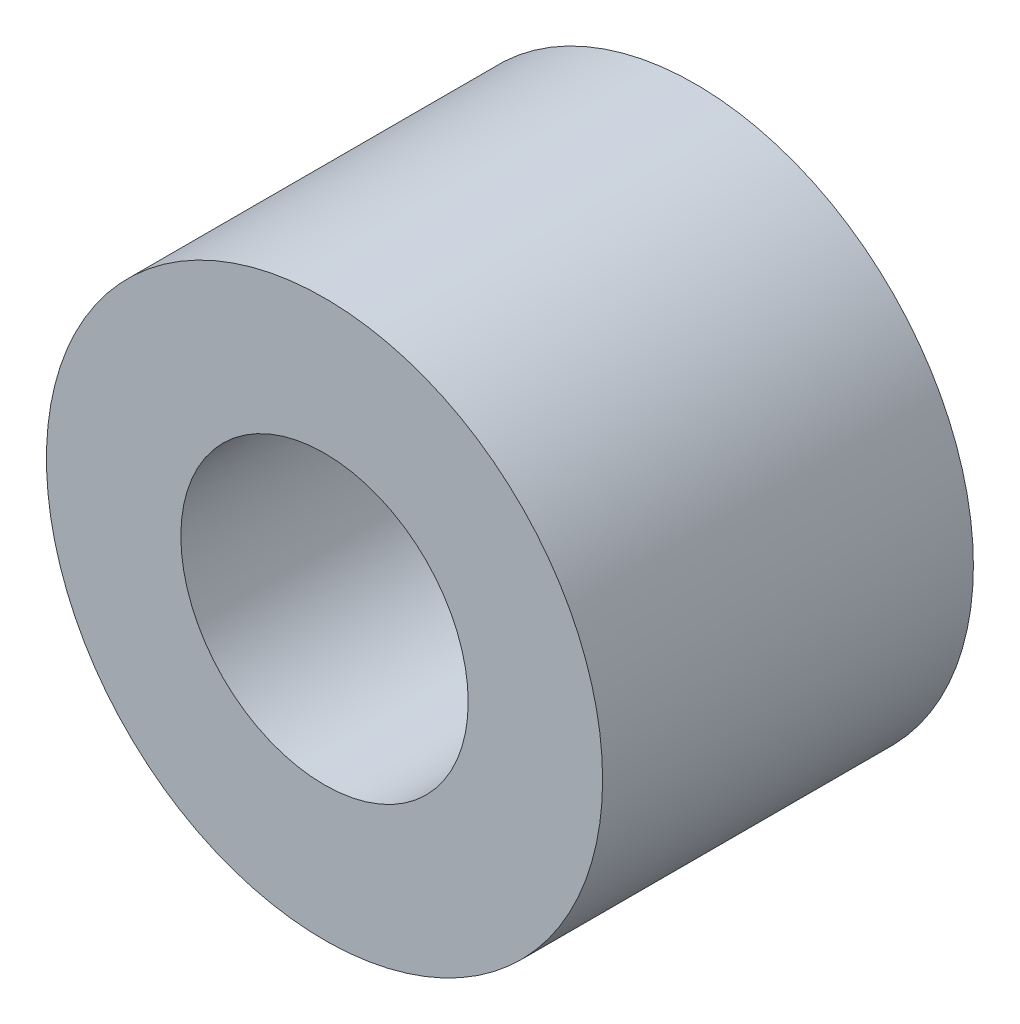
ISO-10303-21;
HEADER;
FILE_DESCRIPTION(('STEP AP214'),'2;1');
FILE_NAME('part.step','',(''),(''),'','','');
FILE_SCHEMA(('AUTOMOTIVE_DESIGN { 1 0 10303 214 1 1 1 1 }'));
ENDSEC;
DATA;
#1=APPLICATION_CONTEXT('core data for automotive mechanical design processes');
#2=APPLICATION_PROTOCOL_DEFINITION('international standard','automotive_design',2000,#1);
#3=PRODUCT_CONTEXT('',#1,'mechanical');
#4=PRODUCT('Part','Part','',(#3));
#5=PRODUCT_RELATED_PRODUCT_CATEGORY('part','',(#4));
#6=PRODUCT_DEFINITION_FORMATION('','',#4);
#7=PRODUCT_DEFINITION_CONTEXT('part definition',#1,'design');
#8=PRODUCT_DEFINITION('design','',#6,#7);
#9=PRODUCT_DEFINITION_SHAPE('','',#8);
#10=(LENGTH_UNIT() NAMED_UNIT(*) SI_UNIT(.MILLI.,.METRE.));
#11=(NAMED_UNIT(*) PLANE_ANGLE_UNIT() SI_UNIT($,.RADIAN.));
#12=(NAMED_UNIT(*) SI_UNIT($,.STERADIAN.) SOLID_ANGLE_UNIT());
#13=UNCERTAINTY_MEASURE_WITH_UNIT(LENGTH_MEASURE(1.E-05),#10,'distance_accuracy_value','');
#14=(GEOMETRIC_REPRESENTATION_CONTEXT(3) GLOBAL_UNCERTAINTY_ASSIGNED_CONTEXT((#13)) GLOBAL_UNIT_ASSIGNED_CONTEXT((#10,
#11,#12)) REPRESENTATION_CONTEXT('',''));
#15=CARTESIAN_POINT('',(0.,0.,0.));
#16=DIRECTION('',(0.,0.,1.));
#17=DIRECTION('',(1.,0.,0.));
#18=AXIS2_PLACEMENT_3D('',#15,#16,#17);
#19=CARTESIAN_POINT('',(0.,0.,4.));
#20=DIRECTION('',(0.,0.,1.));
#21=DIRECTION('',(1.,0.,0.));
#22=AXIS2_PLACEMENT_3D('',#19,#20,#21);
#23=PLANE('',#22);
#24=CARTESIAN_POINT('',(0.,0.,4.));
#25=DIRECTION('',(0.,0.,1.));
#26=DIRECTION('',(1.,0.,0.));
#27=AXIS2_PLACEMENT_3D('',#24,#25,#26);
#28=CIRCLE('',#27,3.);
#29=CARTESIAN_POINT('',(3.,0.,4.));
#30=VERTEX_POINT('',#29);
#31=EDGE_CURVE('E10',#30,#30,#28,.T.);
#32=ORIENTED_EDGE('',*,*,#31,.T.);
#33=EDGE_LOOP('',(#32));
#34=FACE_BOUND('',#33,.T.);
#35=CARTESIAN_POINT('',(0.,0.,4.));
#36=DIRECTION('',(0.,0.,1.));
#37=DIRECTION('',(1.,0.,0.));
#38=AXIS2_PLACEMENT_3D('',#35,#36,#37);
#39=CIRCLE('',#38,1.55);
#40=CARTESIAN_POINT('',(1.55,0.,4.));
#41=VERTEX_POINT('',#40);
#42=EDGE_CURVE('E43',#41,#41,#39,.T.);
#43=ORIENTED_EDGE('',*,*,#42,.F.);
#44=EDGE_LOOP('',(#43));
#45=FACE_BOUND('',#44,.T.);
#46=ADVANCED_FACE('F32',(#34,#45),#23,.T.);
#47=CARTESIAN_POINT('',(0.,0.,0.));
#48=DIRECTION('',(0.,0.,1.));
#49=DIRECTION('',(1.,0.,0.));
#50=AXIS2_PLACEMENT_3D('',#47,#48,#49);
#51=PLANE('',#50);
#52=CARTESIAN_POINT('',(0.,0.,0.));
#53=DIRECTION('',(0.,0.,1.));
#54=DIRECTION('',(1.,0.,0.));
#55=AXIS2_PLACEMENT_3D('',#52,#53,#54);
#56=CIRCLE('',#55,3.);
#57=CARTESIAN_POINT('',(3.,0.,0.));
#58=VERTEX_POINT('',#57);
#59=EDGE_CURVE('E36',#58,#58,#56,.T.);
#60=ORIENTED_EDGE('',*,*,#59,.F.);
#61=EDGE_LOOP('',(#60));
#62=FACE_BOUND('',#61,.T.);
#63=CARTESIAN_POINT('',(0.,0.,0.));
#64=DIRECTION('',(0.,0.,1.));
#65=DIRECTION('',(1.,0.,0.));
#66=AXIS2_PLACEMENT_3D('',#63,#64,#65);
#67=CIRCLE('',#66,1.55);
#68=CARTESIAN_POINT('',(1.55,0.,0.));
#69=VERTEX_POINT('',#68);
#70=EDGE_CURVE('E45',#69,#69,#67,.T.);
#71=ORIENTED_EDGE('',*,*,#70,.T.);
#72=EDGE_LOOP('',(#71));
#73=FACE_BOUND('',#72,.T.);
#74=ADVANCED_FACE('F55',(#62,#73),#51,.F.);
#75=CARTESIAN_POINT('',(0.,0.,4.));
#76=DIRECTION('',(0.,0.,-1.));
#77=DIRECTION('',(-1.,0.,0.));
#78=AXIS2_PLACEMENT_3D('',#75,#76,#77);
#79=CYLINDRICAL_SURFACE('',#78,3.);
#80=ORIENTED_EDGE('',*,*,#31,.F.);
#81=EDGE_LOOP('',(#80));
#82=FACE_BOUND('',#81,.T.);
#83=ORIENTED_EDGE('',*,*,#59,.T.);
#84=EDGE_LOOP('',(#83));
#85=FACE_BOUND('',#84,.T.);
#86=ADVANCED_FACE('F34',(#82,#85),#79,.T.);
#87=CARTESIAN_POINT('',(0.,0.,4.));
#88=DIRECTION('',(0.,0.,-1.));
#89=DIRECTION('',(-1.,0.,0.));
#90=AXIS2_PLACEMENT_3D('',#87,#88,#89);
#91=CYLINDRICAL_SURFACE('',#90,1.55);
#92=ORIENTED_EDGE('',*,*,#42,.T.);
#93=EDGE_LOOP('',(#92));
#94=FACE_BOUND('',#93,.T.);
#95=ORIENTED_EDGE('',*,*,#70,.F.);
#96=EDGE_LOOP('',(#95));
#97=FACE_BOUND('',#96,.T.);
#98=ADVANCED_FACE('F51',(#94,#97),#91,.F.);
#99=CLOSED_SHELL('',(#46,#74,#86,#98));
#100=MANIFOLD_SOLID_BREP('B2',#99);
#101=ADVANCED_BREP_SHAPE_REPRESENTATION('',(#18,#100),#14);
#102=SHAPE_DEFINITION_REPRESENTATION(#9,#101);
ENDSEC;
END-ISO-10303-21;
